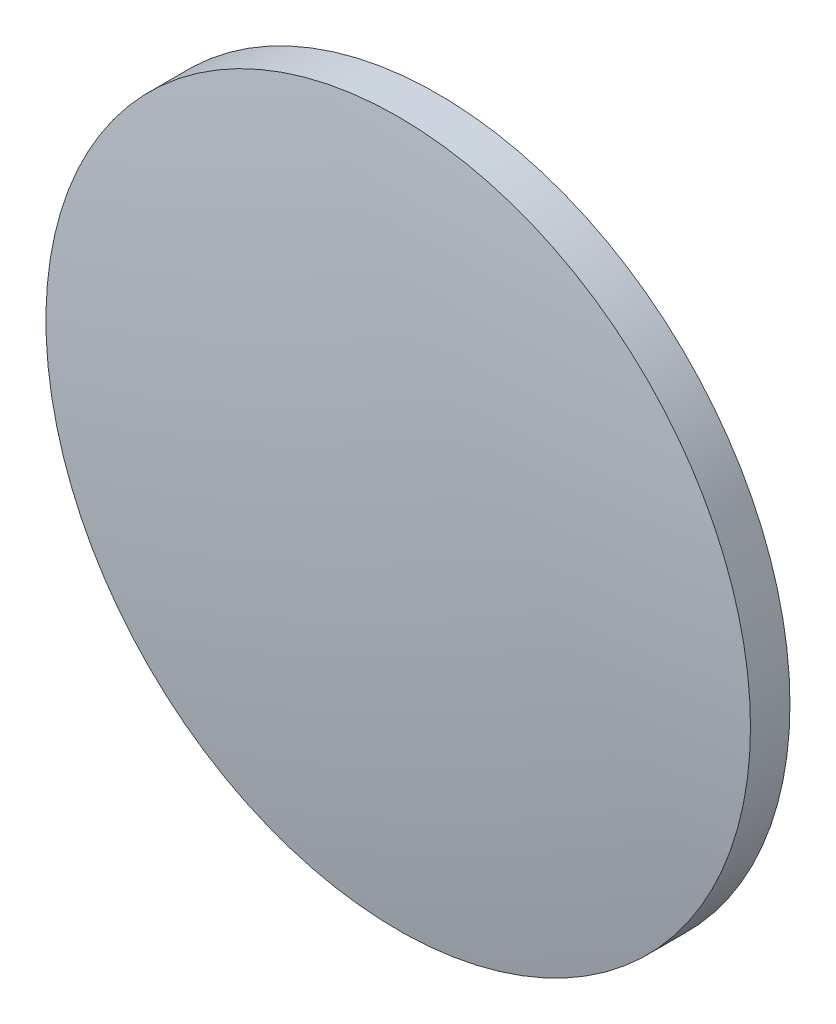
ISO-10303-21;
HEADER;
FILE_DESCRIPTION(('STEP AP214'),'2;1');
FILE_NAME('part.step','',(''),(''),'','','');
FILE_SCHEMA(('AUTOMOTIVE_DESIGN { 1 0 10303 214 1 1 1 1 }'));
ENDSEC;
DATA;
#1=APPLICATION_CONTEXT('core data for automotive mechanical design processes');
#2=APPLICATION_PROTOCOL_DEFINITION('international standard','automotive_design',2000,#1);
#3=PRODUCT_CONTEXT('',#1,'mechanical');
#4=PRODUCT('Part','Part','',(#3));
#5=PRODUCT_RELATED_PRODUCT_CATEGORY('part','',(#4));
#6=PRODUCT_DEFINITION_FORMATION('','',#4);
#7=PRODUCT_DEFINITION_CONTEXT('part definition',#1,'design');
#8=PRODUCT_DEFINITION('design','',#6,#7);
#9=PRODUCT_DEFINITION_SHAPE('','',#8);
#10=(LENGTH_UNIT() NAMED_UNIT(*) SI_UNIT(.MILLI.,.METRE.));
#11=(NAMED_UNIT(*) PLANE_ANGLE_UNIT() SI_UNIT($,.RADIAN.));
#12=(NAMED_UNIT(*) SI_UNIT($,.STERADIAN.) SOLID_ANGLE_UNIT());
#13=UNCERTAINTY_MEASURE_WITH_UNIT(LENGTH_MEASURE(1.E-05),#10,'distance_accuracy_value','');
#14=(GEOMETRIC_REPRESENTATION_CONTEXT(3) GLOBAL_UNCERTAINTY_ASSIGNED_CONTEXT((#13)) GLOBAL_UNIT_ASSIGNED_CONTEXT((#10,
#11,#12)) REPRESENTATION_CONTEXT('',''));
#15=CARTESIAN_POINT('',(0.,0.,0.));
#16=DIRECTION('',(0.,0.,1.));
#17=DIRECTION('',(1.,0.,0.));
#18=AXIS2_PLACEMENT_3D('',#15,#16,#17);
#19=CARTESIAN_POINT('',(0.,0.,-101.62));
#20=DIRECTION('',(0.,0.,1.));
#21=DIRECTION('',(0.,1.,0.));
#22=AXIS2_PLACEMENT_3D('',#19,#20,#21);
#23=SPHERICAL_SURFACE('',#22,103.01);
#24=CARTESIAN_POINT('',(0.,0.,0.292021371377001));
#25=DIRECTION('',(0.,0.,1.));
#26=DIRECTION('',(1.,0.,0.));
#27=AXIS2_PLACEMENT_3D('',#24,#25,#26);
#28=CIRCLE('',#27,15.);
#29=CARTESIAN_POINT('',(15.,0.,0.292021371377001));
#30=VERTEX_POINT('',#29);
#31=EDGE_CURVE('E8',#30,#30,#28,.T.);
#32=ORIENTED_EDGE('',*,*,#31,.T.);
#33=EDGE_LOOP('',(#32));
#34=FACE_BOUND('',#33,.T.);
#35=ADVANCED_FACE('F12',(#34),#23,.T.);
#36=CARTESIAN_POINT('',(0.,0.,4.30813204540037));
#37=DIRECTION('',(0.,0.,1.));
#38=DIRECTION('',(1.,0.,0.));
#39=AXIS2_PLACEMENT_3D('',#36,#37,#38);
#40=CYLINDRICAL_SURFACE('',#39,15.);
#41=ORIENTED_EDGE('',*,*,#31,.F.);
#42=EDGE_LOOP('',(#41));
#43=FACE_BOUND('',#42,.T.);
#44=CARTESIAN_POINT('',(0.,0.,-1.39));
#45=DIRECTION('',(0.,0.,1.));
#46=DIRECTION('',(1.,0.,0.));
#47=AXIS2_PLACEMENT_3D('',#44,#45,#46);
#48=CIRCLE('',#47,15.);
#49=CARTESIAN_POINT('',(15.,0.,-1.39));
#50=VERTEX_POINT('',#49);
#51=EDGE_CURVE('E18',#50,#50,#48,.T.);
#52=ORIENTED_EDGE('',*,*,#51,.T.);
#53=EDGE_LOOP('',(#52));
#54=FACE_BOUND('',#53,.T.);
#55=ADVANCED_FACE('F24',(#43,#54),#40,.T.);
#56=CARTESIAN_POINT('',(0.,0.,-1.39));
#57=DIRECTION('',(0.,0.,1.));
#58=DIRECTION('',(1.,0.,0.));
#59=AXIS2_PLACEMENT_3D('',#56,#57,#58);
#60=PLANE('',#59);
#61=ORIENTED_EDGE('',*,*,#51,.F.);
#62=EDGE_LOOP('',(#61));
#63=FACE_BOUND('',#62,.T.);
#64=ADVANCED_FACE('F26',(#63),#60,.F.);
#65=CLOSED_SHELL('',(#35,#55,#64));
#66=MANIFOLD_SOLID_BREP('B1',#65);
#67=ADVANCED_BREP_SHAPE_REPRESENTATION('',(#18,#66),#14);
#68=SHAPE_DEFINITION_REPRESENTATION(#9,#67);
ENDSEC;
END-ISO-10303-21;
